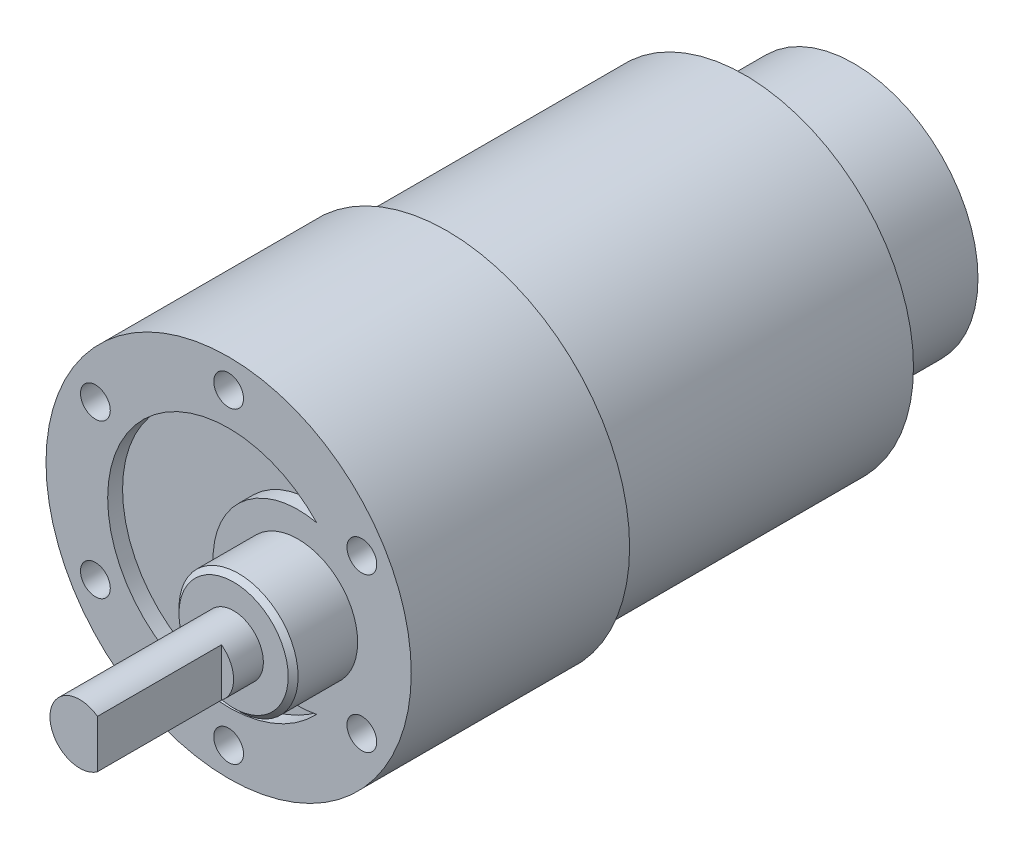
ISO-10303-21;
HEADER;
FILE_DESCRIPTION(('STEP AP214'),'2;1');
FILE_NAME('part.step','',(''),(''),'','','');
FILE_SCHEMA(('AUTOMOTIVE_DESIGN { 1 0 10303 214 1 1 1 1 }'));
ENDSEC;
DATA;
#1=APPLICATION_CONTEXT('core data for automotive mechanical design processes');
#2=APPLICATION_PROTOCOL_DEFINITION('international standard','automotive_design',2000,#1);
#3=PRODUCT_CONTEXT('',#1,'mechanical');
#4=PRODUCT('Part','Part','',(#3));
#5=PRODUCT_RELATED_PRODUCT_CATEGORY('part','',(#4));
#6=PRODUCT_DEFINITION_FORMATION('','',#4);
#7=PRODUCT_DEFINITION_CONTEXT('part definition',#1,'design');
#8=PRODUCT_DEFINITION('design','',#6,#7);
#9=PRODUCT_DEFINITION_SHAPE('','',#8);
#10=(LENGTH_UNIT() NAMED_UNIT(*) SI_UNIT(.MILLI.,.METRE.));
#11=(NAMED_UNIT(*) PLANE_ANGLE_UNIT() SI_UNIT($,.RADIAN.));
#12=(NAMED_UNIT(*) SI_UNIT($,.STERADIAN.) SOLID_ANGLE_UNIT());
#13=UNCERTAINTY_MEASURE_WITH_UNIT(LENGTH_MEASURE(1.E-05),#10,'distance_accuracy_value','');
#14=(GEOMETRIC_REPRESENTATION_CONTEXT(3) GLOBAL_UNCERTAINTY_ASSIGNED_CONTEXT((#13)) GLOBAL_UNIT_ASSIGNED_CONTEXT((#10,
#11,#12)) REPRESENTATION_CONTEXT('',''));
#15=CARTESIAN_POINT('',(0.,0.,0.));
#16=DIRECTION('',(0.,0.,1.));
#17=DIRECTION('',(1.,0.,0.));
#18=AXIS2_PLACEMENT_3D('',#15,#16,#17);
#19=CARTESIAN_POINT('',(0.,0.,0.));
#20=DIRECTION('',(0.,0.,1.));
#21=DIRECTION('',(1.,0.,0.));
#22=AXIS2_PLACEMENT_3D('',#19,#20,#21);
#23=PLANE('',#22);
#24=CARTESIAN_POINT('',(0.,0.,0.));
#25=DIRECTION('',(0.,0.,1.));
#26=DIRECTION('',(1.,0.,0.));
#27=AXIS2_PLACEMENT_3D('',#24,#25,#26);
#28=CIRCLE('',#27,17.);
#29=CARTESIAN_POINT('',(17.,0.,0.));
#30=VERTEX_POINT('',#29);
#31=EDGE_CURVE('E145',#30,#30,#28,.T.);
#32=ORIENTED_EDGE('',*,*,#31,.F.);
#33=EDGE_LOOP('',(#32));
#34=FACE_BOUND('',#33,.T.);
#35=CARTESIAN_POINT('',(0.,0.,0.));
#36=DIRECTION('',(0.,0.,1.));
#37=DIRECTION('',(1.,0.,0.));
#38=AXIS2_PLACEMENT_3D('',#35,#36,#37);
#39=CIRCLE('',#38,12.5);
#40=CARTESIAN_POINT('',(12.5,0.,0.));
#41=VERTEX_POINT('',#40);
#42=EDGE_CURVE('E13',#41,#41,#39,.F.);
#43=ORIENTED_EDGE('',*,*,#42,.F.);
#44=EDGE_LOOP('',(#43));
#45=FACE_BOUND('',#44,.T.);
#46=ADVANCED_FACE('F37',(#34,#45),#23,.F.);
#47=CARTESIAN_POINT('',(0.,0.,52.));
#48=DIRECTION('',(0.,0.,1.));
#49=DIRECTION('',(1.,0.,0.));
#50=AXIS2_PLACEMENT_3D('',#47,#48,#49);
#51=PLANE('',#50);
#52=CARTESIAN_POINT('',(7.,0.,52.));
#53=DIRECTION('',(0.,0.,1.));
#54=DIRECTION('',(1.,0.,0.));
#55=AXIS2_PLACEMENT_3D('',#52,#53,#54);
#56=CIRCLE('',#55,6.);
#57=CARTESIAN_POINT('',(13.,0.,52.));
#58=VERTEX_POINT('',#57);
#59=EDGE_CURVE('E93',#58,#58,#56,.T.);
#60=ORIENTED_EDGE('',*,*,#59,.F.);
#61=EDGE_LOOP('',(#60));
#62=FACE_BOUND('',#61,.T.);
#63=CARTESIAN_POINT('',(-13.4233937586587,7.75000000000016,52.));
#64=DIRECTION('',(0.,0.,1.));
#65=DIRECTION('',(1.,0.,0.));
#66=AXIS2_PLACEMENT_3D('',#63,#64,#65);
#67=CIRCLE('',#66,1.5);
#68=CARTESIAN_POINT('',(-11.9233937586587,7.75000000000016,52.));
#69=VERTEX_POINT('',#68);
#70=EDGE_CURVE('E97',#69,#69,#67,.T.);
#71=ORIENTED_EDGE('',*,*,#70,.F.);
#72=EDGE_LOOP('',(#71));
#73=FACE_BOUND('',#72,.T.);
#74=CARTESIAN_POINT('',(-13.4233937586589,-7.74999999999987,52.));
#75=DIRECTION('',(0.,0.,1.));
#76=DIRECTION('',(1.,0.,0.));
#77=AXIS2_PLACEMENT_3D('',#74,#75,#76);
#78=CIRCLE('',#77,1.5);
#79=CARTESIAN_POINT('',(-11.9233937586589,-7.74999999999987,52.));
#80=VERTEX_POINT('',#79);
#81=EDGE_CURVE('E109',#80,#80,#78,.T.);
#82=ORIENTED_EDGE('',*,*,#81,.F.);
#83=EDGE_LOOP('',(#82));
#84=FACE_BOUND('',#83,.T.);
#85=CARTESIAN_POINT('',(-1.08235921504137E-13,-15.5,52.));
#86=DIRECTION('',(0.,0.,1.));
#87=DIRECTION('',(1.,0.,0.));
#88=AXIS2_PLACEMENT_3D('',#85,#86,#87);
#89=CIRCLE('',#88,1.5);
#90=CARTESIAN_POINT('',(1.49999999999989,-15.5,52.));
#91=VERTEX_POINT('',#90);
#92=EDGE_CURVE('E115',#91,#91,#89,.T.);
#93=ORIENTED_EDGE('',*,*,#92,.F.);
#94=EDGE_LOOP('',(#93));
#95=FACE_BOUND('',#94,.T.);
#96=CARTESIAN_POINT('',(13.4233937586588,-7.75000000000006,52.));
#97=DIRECTION('',(0.,0.,1.));
#98=DIRECTION('',(1.,0.,0.));
#99=AXIS2_PLACEMENT_3D('',#96,#97,#98);
#100=CIRCLE('',#99,1.5);
#101=CARTESIAN_POINT('',(14.9233937586588,-7.75000000000006,52.));
#102=VERTEX_POINT('',#101);
#103=EDGE_CURVE('E121',#102,#102,#100,.T.);
#104=ORIENTED_EDGE('',*,*,#103,.F.);
#105=EDGE_LOOP('',(#104));
#106=FACE_BOUND('',#105,.T.);
#107=CARTESIAN_POINT('',(13.4233937586588,7.74999999999997,52.));
#108=DIRECTION('',(0.,0.,1.));
#109=DIRECTION('',(1.,0.,0.));
#110=AXIS2_PLACEMENT_3D('',#107,#108,#109);
#111=CIRCLE('',#110,1.5);
#112=CARTESIAN_POINT('',(14.9233937586588,7.74999999999997,52.));
#113=VERTEX_POINT('',#112);
#114=EDGE_CURVE('E127',#113,#113,#111,.T.);
#115=ORIENTED_EDGE('',*,*,#114,.F.);
#116=EDGE_LOOP('',(#115));
#117=FACE_BOUND('',#116,.T.);
#118=CARTESIAN_POINT('',(0.,15.5,52.));
#119=DIRECTION('',(0.,0.,1.));
#120=DIRECTION('',(1.,0.,0.));
#121=AXIS2_PLACEMENT_3D('',#118,#119,#120);
#122=CIRCLE('',#121,1.5);
#123=CARTESIAN_POINT('',(1.5,15.5,52.));
#124=VERTEX_POINT('',#123);
#125=EDGE_CURVE('E133',#124,#124,#122,.T.);
#126=ORIENTED_EDGE('',*,*,#125,.F.);
#127=EDGE_LOOP('',(#126));
#128=FACE_BOUND('',#127,.T.);
#129=CARTESIAN_POINT('',(0.,0.,52.));
#130=DIRECTION('',(0.,0.,1.));
#131=DIRECTION('',(1.,0.,0.));
#132=AXIS2_PLACEMENT_3D('',#129,#130,#131);
#133=CIRCLE('',#132,18.4);
#134=CARTESIAN_POINT('',(18.4,0.,52.));
#135=VERTEX_POINT('',#134);
#136=EDGE_CURVE('E142',#135,#135,#133,.T.);
#137=ORIENTED_EDGE('',*,*,#136,.T.);
#138=EDGE_LOOP('',(#137));
#139=FACE_BOUND('',#138,.T.);
#140=CARTESIAN_POINT('',(0.,0.,52.));
#141=DIRECTION('',(0.,0.,1.));
#142=DIRECTION('',(1.,0.,0.));
#143=AXIS2_PLACEMENT_3D('',#140,#141,#142);
#144=CIRCLE('',#143,12.1872331613627);
#145=CARTESIAN_POINT('',(8.86813473528428,8.35971521322723,52.));
#146=VERTEX_POINT('',#145);
#147=CARTESIAN_POINT('',(8.86813473528428,-8.35971521322723,52.));
#148=VERTEX_POINT('',#147);
#149=EDGE_CURVE('E381',#146,#148,#144,.T.);
#150=ORIENTED_EDGE('',*,*,#149,.F.);
#151=CARTESIAN_POINT('',(7.,0.,52.));
#152=DIRECTION('',(0.,0.,1.));
#153=DIRECTION('',(1.,0.,0.));
#154=AXIS2_PLACEMENT_3D('',#151,#152,#153);
#155=CIRCLE('',#154,8.56590718111272);
#156=EDGE_CURVE('E60',#146,#148,#155,.T.);
#157=ORIENTED_EDGE('',*,*,#156,.T.);
#158=EDGE_LOOP('',(#150,#157));
#159=FACE_BOUND('',#158,.T.);
#160=ADVANCED_FACE('F172',(#62,#73,#84,#95,#106,#117,#128,#139,#159),#51,.T.);
#161=CARTESIAN_POINT('',(7.,0.,58.5));
#162=DIRECTION('',(0.,0.,1.));
#163=DIRECTION('',(1.,0.,0.));
#164=AXIS2_PLACEMENT_3D('',#161,#162,#163);
#165=PLANE('',#164);
#166=CARTESIAN_POINT('',(7.,0.,58.5));
#167=DIRECTION('',(0.,0.,1.));
#168=DIRECTION('',(1.,0.,0.));
#169=AXIS2_PLACEMENT_3D('',#166,#167,#168);
#170=CIRCLE('',#169,5.50000000000002);
#171=CARTESIAN_POINT('',(12.5,0.,58.5));
#172=VERTEX_POINT('',#171);
#173=EDGE_CURVE('E156',#172,#172,#170,.T.);
#174=ORIENTED_EDGE('',*,*,#173,.T.);
#175=EDGE_LOOP('',(#174));
#176=FACE_BOUND('',#175,.T.);
#177=CARTESIAN_POINT('',(7.,0.,58.5));
#178=DIRECTION('',(0.,0.,1.));
#179=DIRECTION('',(1.,0.,0.));
#180=AXIS2_PLACEMENT_3D('',#177,#178,#179);
#181=CIRCLE('',#180,3.);
#182=CARTESIAN_POINT('',(10.,0.,58.5));
#183=VERTEX_POINT('',#182);
#184=EDGE_CURVE('E94',#183,#183,#181,.T.);
#185=ORIENTED_EDGE('',*,*,#184,.F.);
#186=EDGE_LOOP('',(#185));
#187=FACE_BOUND('',#186,.T.);
#188=ADVANCED_FACE('F168',(#176,#187),#165,.T.);
#189=CARTESIAN_POINT('',(0.,0.,30.));
#190=DIRECTION('',(0.,0.,-1.));
#191=DIRECTION('',(-1.,0.,0.));
#192=AXIS2_PLACEMENT_3D('',#189,#190,#191);
#193=CYLINDRICAL_SURFACE('',#192,17.);
#194=CARTESIAN_POINT('',(0.,0.,29.));
#195=DIRECTION('',(0.,0.,1.));
#196=DIRECTION('',(1.,0.,0.));
#197=AXIS2_PLACEMENT_3D('',#194,#195,#196);
#198=CIRCLE('',#197,17.);
#199=CARTESIAN_POINT('',(17.,0.,29.));
#200=VERTEX_POINT('',#199);
#201=EDGE_CURVE('E153',#200,#200,#198,.F.);
#202=ORIENTED_EDGE('',*,*,#201,.T.);
#203=EDGE_LOOP('',(#202));
#204=FACE_BOUND('',#203,.T.);
#205=ORIENTED_EDGE('',*,*,#31,.T.);
#206=EDGE_LOOP('',(#205));
#207=FACE_BOUND('',#206,.T.);
#208=ADVANCED_FACE('F171',(#204,#207),#193,.T.);
#209=CARTESIAN_POINT('',(0.,0.,29.));
#210=DIRECTION('',(0.,0.,1.));
#211=DIRECTION('',(1.,0.,0.));
#212=AXIS2_PLACEMENT_3D('',#209,#210,#211);
#213=TOROIDAL_SURFACE('',#212,16.,1.);
#214=ORIENTED_EDGE('',*,*,#201,.F.);
#215=EDGE_LOOP('',(#214));
#216=FACE_BOUND('',#215,.T.);
#217=CARTESIAN_POINT('',(0.,0.,30.));
#218=DIRECTION('',(0.,0.,1.));
#219=DIRECTION('',(1.,0.,0.));
#220=AXIS2_PLACEMENT_3D('',#217,#218,#219);
#221=CIRCLE('',#220,16.);
#222=CARTESIAN_POINT('',(16.,0.,30.));
#223=VERTEX_POINT('',#222);
#224=EDGE_CURVE('E150',#223,#223,#221,.T.);
#225=ORIENTED_EDGE('',*,*,#224,.F.);
#226=EDGE_LOOP('',(#225));
#227=FACE_BOUND('',#226,.T.);
#228=ADVANCED_FACE('F197',(#216,#227),#213,.T.);
#229=CARTESIAN_POINT('',(0.,0.,52.));
#230=DIRECTION('',(0.,0.,-1.));
#231=DIRECTION('',(-1.,0.,0.));
#232=AXIS2_PLACEMENT_3D('',#229,#230,#231);
#233=CYLINDRICAL_SURFACE('',#232,18.4);
#234=ORIENTED_EDGE('',*,*,#136,.F.);
#235=EDGE_LOOP('',(#234));
#236=FACE_BOUND('',#235,.T.);
#237=CARTESIAN_POINT('',(0.,0.,30.));
#238=DIRECTION('',(0.,0.,1.));
#239=DIRECTION('',(1.,0.,0.));
#240=AXIS2_PLACEMENT_3D('',#237,#238,#239);
#241=CIRCLE('',#240,18.4);
#242=CARTESIAN_POINT('',(18.4,0.,30.));
#243=VERTEX_POINT('',#242);
#244=EDGE_CURVE('E139',#243,#243,#241,.T.);
#245=ORIENTED_EDGE('',*,*,#244,.T.);
#246=EDGE_LOOP('',(#245));
#247=FACE_BOUND('',#246,.T.);
#248=ADVANCED_FACE('F194',(#236,#247),#233,.T.);
#249=CARTESIAN_POINT('',(0.,0.,30.));
#250=DIRECTION('',(0.,0.,1.));
#251=DIRECTION('',(1.,0.,0.));
#252=AXIS2_PLACEMENT_3D('',#249,#250,#251);
#253=PLANE('',#252);
#254=ORIENTED_EDGE('',*,*,#224,.T.);
#255=EDGE_LOOP('',(#254));
#256=FACE_BOUND('',#255,.T.);
#257=ORIENTED_EDGE('',*,*,#244,.F.);
#258=EDGE_LOOP('',(#257));
#259=FACE_BOUND('',#258,.T.);
#260=ADVANCED_FACE('F204',(#256,#259),#253,.F.);
#261=CARTESIAN_POINT('',(0.,15.5,49.));
#262=DIRECTION('',(0.,0.,1.));
#263=DIRECTION('',(1.,0.,0.));
#264=AXIS2_PLACEMENT_3D('',#261,#262,#263);
#265=CYLINDRICAL_SURFACE('',#264,1.5);
#266=CARTESIAN_POINT('',(0.,15.5,49.));
#267=DIRECTION('',(0.,0.,1.));
#268=DIRECTION('',(1.,0.,0.));
#269=AXIS2_PLACEMENT_3D('',#266,#267,#268);
#270=CIRCLE('',#269,1.5);
#271=CARTESIAN_POINT('',(1.5,15.5,49.));
#272=VERTEX_POINT('',#271);
#273=EDGE_CURVE('E136',#272,#272,#270,.T.);
#274=ORIENTED_EDGE('',*,*,#273,.F.);
#275=EDGE_LOOP('',(#274));
#276=FACE_BOUND('',#275,.T.);
#277=ORIENTED_EDGE('',*,*,#125,.T.);
#278=EDGE_LOOP('',(#277));
#279=FACE_BOUND('',#278,.T.);
#280=ADVANCED_FACE('F212',(#276,#279),#265,.F.);
#281=CARTESIAN_POINT('',(0.,15.5,49.));
#282=DIRECTION('',(0.,0.,1.));
#283=DIRECTION('',(1.,0.,0.));
#284=AXIS2_PLACEMENT_3D('',#281,#282,#283);
#285=PLANE('',#284);
#286=ORIENTED_EDGE('',*,*,#273,.T.);
#287=EDGE_LOOP('',(#286));
#288=FACE_BOUND('',#287,.T.);
#289=ADVANCED_FACE('F218',(#288),#285,.T.);
#290=CARTESIAN_POINT('',(13.4233937586588,7.74999999999997,49.));
#291=DIRECTION('',(0.,0.,1.));
#292=DIRECTION('',(1.,0.,0.));
#293=AXIS2_PLACEMENT_3D('',#290,#291,#292);
#294=CYLINDRICAL_SURFACE('',#293,1.5);
#295=CARTESIAN_POINT('',(13.4233937586588,7.74999999999997,49.));
#296=DIRECTION('',(0.,0.,1.));
#297=DIRECTION('',(1.,0.,0.));
#298=AXIS2_PLACEMENT_3D('',#295,#296,#297);
#299=CIRCLE('',#298,1.5);
#300=CARTESIAN_POINT('',(14.9233937586588,7.74999999999997,49.));
#301=VERTEX_POINT('',#300);
#302=EDGE_CURVE('E130',#301,#301,#299,.T.);
#303=ORIENTED_EDGE('',*,*,#302,.F.);
#304=EDGE_LOOP('',(#303));
#305=FACE_BOUND('',#304,.T.);
#306=ORIENTED_EDGE('',*,*,#114,.T.);
#307=EDGE_LOOP('',(#306));
#308=FACE_BOUND('',#307,.T.);
#309=ADVANCED_FACE('F224',(#305,#308),#294,.F.);
#310=CARTESIAN_POINT('',(13.4233937586588,7.74999999999997,49.));
#311=DIRECTION('',(0.,0.,1.));
#312=DIRECTION('',(1.,0.,0.));
#313=AXIS2_PLACEMENT_3D('',#310,#311,#312);
#314=PLANE('',#313);
#315=ORIENTED_EDGE('',*,*,#302,.T.);
#316=EDGE_LOOP('',(#315));
#317=FACE_BOUND('',#316,.T.);
#318=ADVANCED_FACE('F228',(#317),#314,.T.);
#319=CARTESIAN_POINT('',(13.4233937586588,-7.75000000000006,49.));
#320=DIRECTION('',(0.,0.,1.));
#321=DIRECTION('',(1.,0.,0.));
#322=AXIS2_PLACEMENT_3D('',#319,#320,#321);
#323=CYLINDRICAL_SURFACE('',#322,1.5);
#324=CARTESIAN_POINT('',(13.4233937586588,-7.75000000000006,49.));
#325=DIRECTION('',(0.,0.,1.));
#326=DIRECTION('',(1.,0.,0.));
#327=AXIS2_PLACEMENT_3D('',#324,#325,#326);
#328=CIRCLE('',#327,1.5);
#329=CARTESIAN_POINT('',(14.9233937586588,-7.75000000000006,49.));
#330=VERTEX_POINT('',#329);
#331=EDGE_CURVE('E124',#330,#330,#328,.T.);
#332=ORIENTED_EDGE('',*,*,#331,.F.);
#333=EDGE_LOOP('',(#332));
#334=FACE_BOUND('',#333,.T.);
#335=ORIENTED_EDGE('',*,*,#103,.T.);
#336=EDGE_LOOP('',(#335));
#337=FACE_BOUND('',#336,.T.);
#338=ADVANCED_FACE('F232',(#334,#337),#323,.F.);
#339=CARTESIAN_POINT('',(13.4233937586588,-7.75000000000006,49.));
#340=DIRECTION('',(0.,0.,1.));
#341=DIRECTION('',(1.,0.,0.));
#342=AXIS2_PLACEMENT_3D('',#339,#340,#341);
#343=PLANE('',#342);
#344=ORIENTED_EDGE('',*,*,#331,.T.);
#345=EDGE_LOOP('',(#344));
#346=FACE_BOUND('',#345,.T.);
#347=ADVANCED_FACE('F236',(#346),#343,.T.);
#348=CARTESIAN_POINT('',(-1.08235921504137E-13,-15.5,49.));
#349=DIRECTION('',(0.,0.,1.));
#350=DIRECTION('',(1.,0.,0.));
#351=AXIS2_PLACEMENT_3D('',#348,#349,#350);
#352=CYLINDRICAL_SURFACE('',#351,1.5);
#353=CARTESIAN_POINT('',(-1.08235921504137E-13,-15.5,49.));
#354=DIRECTION('',(0.,0.,1.));
#355=DIRECTION('',(1.,0.,0.));
#356=AXIS2_PLACEMENT_3D('',#353,#354,#355);
#357=CIRCLE('',#356,1.5);
#358=CARTESIAN_POINT('',(1.49999999999989,-15.5,49.));
#359=VERTEX_POINT('',#358);
#360=EDGE_CURVE('E118',#359,#359,#357,.T.);
#361=ORIENTED_EDGE('',*,*,#360,.F.);
#362=EDGE_LOOP('',(#361));
#363=FACE_BOUND('',#362,.T.);
#364=ORIENTED_EDGE('',*,*,#92,.T.);
#365=EDGE_LOOP('',(#364));
#366=FACE_BOUND('',#365,.T.);
#367=ADVANCED_FACE('F240',(#363,#366),#352,.F.);
#368=CARTESIAN_POINT('',(-1.08235921504137E-13,-15.5,49.));
#369=DIRECTION('',(0.,0.,1.));
#370=DIRECTION('',(1.,0.,0.));
#371=AXIS2_PLACEMENT_3D('',#368,#369,#370);
#372=PLANE('',#371);
#373=ORIENTED_EDGE('',*,*,#360,.T.);
#374=EDGE_LOOP('',(#373));
#375=FACE_BOUND('',#374,.T.);
#376=ADVANCED_FACE('F244',(#375),#372,.T.);
#377=CARTESIAN_POINT('',(-13.4233937586589,-7.74999999999987,49.));
#378=DIRECTION('',(0.,0.,1.));
#379=DIRECTION('',(1.,0.,0.));
#380=AXIS2_PLACEMENT_3D('',#377,#378,#379);
#381=CYLINDRICAL_SURFACE('',#380,1.5);
#382=CARTESIAN_POINT('',(-13.4233937586589,-7.74999999999987,49.));
#383=DIRECTION('',(0.,0.,1.));
#384=DIRECTION('',(1.,0.,0.));
#385=AXIS2_PLACEMENT_3D('',#382,#383,#384);
#386=CIRCLE('',#385,1.5);
#387=CARTESIAN_POINT('',(-11.9233937586589,-7.74999999999987,49.));
#388=VERTEX_POINT('',#387);
#389=EDGE_CURVE('E112',#388,#388,#386,.T.);
#390=ORIENTED_EDGE('',*,*,#389,.F.);
#391=EDGE_LOOP('',(#390));
#392=FACE_BOUND('',#391,.T.);
#393=ORIENTED_EDGE('',*,*,#81,.T.);
#394=EDGE_LOOP('',(#393));
#395=FACE_BOUND('',#394,.T.);
#396=ADVANCED_FACE('F248',(#392,#395),#381,.F.);
#397=CARTESIAN_POINT('',(-13.4233937586589,-7.74999999999987,49.));
#398=DIRECTION('',(0.,0.,1.));
#399=DIRECTION('',(1.,0.,0.));
#400=AXIS2_PLACEMENT_3D('',#397,#398,#399);
#401=PLANE('',#400);
#402=ORIENTED_EDGE('',*,*,#389,.T.);
#403=EDGE_LOOP('',(#402));
#404=FACE_BOUND('',#403,.T.);
#405=ADVANCED_FACE('F252',(#404),#401,.T.);
#406=CARTESIAN_POINT('',(-13.4233937586587,7.75000000000016,49.));
#407=DIRECTION('',(0.,0.,1.));
#408=DIRECTION('',(1.,0.,0.));
#409=AXIS2_PLACEMENT_3D('',#406,#407,#408);
#410=CYLINDRICAL_SURFACE('',#409,1.5);
#411=CARTESIAN_POINT('',(-13.4233937586587,7.75000000000016,49.));
#412=DIRECTION('',(0.,0.,1.));
#413=DIRECTION('',(1.,0.,0.));
#414=AXIS2_PLACEMENT_3D('',#411,#412,#413);
#415=CIRCLE('',#414,1.5);
#416=CARTESIAN_POINT('',(-11.9233937586587,7.75000000000016,49.));
#417=VERTEX_POINT('',#416);
#418=EDGE_CURVE('E106',#417,#417,#415,.T.);
#419=ORIENTED_EDGE('',*,*,#418,.F.);
#420=EDGE_LOOP('',(#419));
#421=FACE_BOUND('',#420,.T.);
#422=ORIENTED_EDGE('',*,*,#70,.T.);
#423=EDGE_LOOP('',(#422));
#424=FACE_BOUND('',#423,.T.);
#425=ADVANCED_FACE('F256',(#421,#424),#410,.F.);
#426=CARTESIAN_POINT('',(-13.4233937586587,7.75000000000016,49.));
#427=DIRECTION('',(0.,0.,1.));
#428=DIRECTION('',(1.,0.,0.));
#429=AXIS2_PLACEMENT_3D('',#426,#427,#428);
#430=PLANE('',#429);
#431=ORIENTED_EDGE('',*,*,#418,.T.);
#432=EDGE_LOOP('',(#431));
#433=FACE_BOUND('',#432,.T.);
#434=ADVANCED_FACE('F260',(#433),#430,.T.);
#435=CARTESIAN_POINT('',(7.,0.,58.5));
#436=DIRECTION('',(0.,0.,-1.));
#437=DIRECTION('',(-1.,0.,0.));
#438=AXIS2_PLACEMENT_3D('',#435,#436,#437);
#439=CYLINDRICAL_SURFACE('',#438,6.);
#440=CARTESIAN_POINT('',(7.,0.,58.));
#441=DIRECTION('',(0.,0.,1.));
#442=DIRECTION('',(1.,0.,0.));
#443=AXIS2_PLACEMENT_3D('',#440,#441,#442);
#444=CIRCLE('',#443,6.);
#445=CARTESIAN_POINT('',(13.,0.,58.));
#446=VERTEX_POINT('',#445);
#447=EDGE_CURVE('E45',#446,#446,#444,.F.);
#448=ORIENTED_EDGE('',*,*,#447,.T.);
#449=EDGE_LOOP('',(#448));
#450=FACE_BOUND('',#449,.T.);
#451=ORIENTED_EDGE('',*,*,#59,.T.);
#452=EDGE_LOOP('',(#451));
#453=FACE_BOUND('',#452,.T.);
#454=ADVANCED_FACE('F161',(#450,#453),#439,.T.);
#455=CARTESIAN_POINT('',(7.,0.,58.5));
#456=DIRECTION('',(0.,0.,-1.));
#457=DIRECTION('',(-1.,0.,0.));
#458=AXIS2_PLACEMENT_3D('',#455,#456,#457);
#459=CONICAL_SURFACE('',#458,5.50000000000002,0.785398163397445);
#460=ORIENTED_EDGE('',*,*,#447,.F.);
#461=EDGE_LOOP('',(#460));
#462=FACE_BOUND('',#461,.T.);
#463=ORIENTED_EDGE('',*,*,#173,.F.);
#464=EDGE_LOOP('',(#463));
#465=FACE_BOUND('',#464,.T.);
#466=ADVANCED_FACE('F39',(#462,#465),#459,.T.);
#467=CARTESIAN_POINT('',(7.,0.,74.));
#468=DIRECTION('',(0.,0.,-1.));
#469=DIRECTION('',(-1.,0.,0.));
#470=AXIS2_PLACEMENT_3D('',#467,#468,#469);
#471=CYLINDRICAL_SURFACE('',#470,3.);
#472=CARTESIAN_POINT('',(7.,0.,74.));
#473=DIRECTION('',(0.,0.,1.));
#474=DIRECTION('',(1.,0.,0.));
#475=AXIS2_PLACEMENT_3D('',#472,#473,#474);
#476=CIRCLE('',#475,3.);
#477=CARTESIAN_POINT('',(8.77935190468652,2.41534817351214,74.));
#478=VERTEX_POINT('',#477);
#479=CARTESIAN_POINT('',(8.77935190468652,-2.41534817351214,74.));
#480=VERTEX_POINT('',#479);
#481=EDGE_CURVE('E88',#478,#480,#476,.T.);
#482=ORIENTED_EDGE('',*,*,#481,.F.);
#483=DIRECTION('',(0.,0.,1.));
#484=VECTOR('',#483,1.);
#485=CARTESIAN_POINT('',(8.77935190468652,2.41534817351214,53.5174696217939));
#486=LINE('',#485,#484);
#487=CARTESIAN_POINT('',(8.77935190468652,2.41534817351214,61.5));
#488=VERTEX_POINT('',#487);
#489=EDGE_CURVE('E52',#488,#478,#486,.T.);
#490=ORIENTED_EDGE('',*,*,#489,.F.);
#491=CARTESIAN_POINT('',(7.,0.,61.5));
#492=DIRECTION('',(0.,0.,1.));
#493=DIRECTION('',(1.,0.,0.));
#494=AXIS2_PLACEMENT_3D('',#491,#492,#493);
#495=CIRCLE('',#494,3.);
#496=CARTESIAN_POINT('',(8.77935190468652,-2.41534817351214,61.5));
#497=VERTEX_POINT('',#496);
#498=EDGE_CURVE('E90',#488,#497,#495,.F.);
#499=ORIENTED_EDGE('',*,*,#498,.T.);
#500=DIRECTION('',(0.,0.,1.));
#501=VECTOR('',#500,1.);
#502=CARTESIAN_POINT('',(8.77935190468652,-2.41534817351214,53.5174696217939));
#503=LINE('',#502,#501);
#504=EDGE_CURVE('E78',#497,#480,#503,.T.);
#505=ORIENTED_EDGE('',*,*,#504,.T.);
#506=EDGE_LOOP('',(#482,#490,#499,#505));
#507=FACE_BOUND('',#506,.T.);
#508=ORIENTED_EDGE('',*,*,#184,.T.);
#509=EDGE_LOOP('',(#508));
#510=FACE_BOUND('',#509,.T.);
#511=ADVANCED_FACE('F86',(#507,#510),#471,.T.);
#512=CARTESIAN_POINT('',(7.,0.,74.));
#513=DIRECTION('',(0.,0.,1.));
#514=DIRECTION('',(1.,0.,0.));
#515=AXIS2_PLACEMENT_3D('',#512,#513,#514);
#516=PLANE('',#515);
#517=DIRECTION('',(0.,-1.,0.));
#518=VECTOR('',#517,1.);
#519=CARTESIAN_POINT('',(8.77935190468652,2.41534817351214,74.));
#520=LINE('',#519,#518);
#521=EDGE_CURVE('E75',#478,#480,#520,.T.);
#522=ORIENTED_EDGE('',*,*,#521,.F.);
#523=ORIENTED_EDGE('',*,*,#481,.T.);
#524=EDGE_LOOP('',(#522,#523));
#525=FACE_BOUND('',#524,.T.);
#526=ADVANCED_FACE('F92',(#525),#516,.T.);
#527=CARTESIAN_POINT('',(7.,0.,50.5));
#528=DIRECTION('',(0.,0.,1.));
#529=DIRECTION('',(1.,0.,0.));
#530=AXIS2_PLACEMENT_3D('',#527,#528,#529);
#531=CYLINDRICAL_SURFACE('',#530,8.56590718111272);
#532=ORIENTED_EDGE('',*,*,#156,.F.);
#533=DIRECTION('',(0.,0.,1.));
#534=VECTOR('',#533,1.);
#535=CARTESIAN_POINT('',(8.86813473528428,8.35971521322723,50.5));
#536=LINE('',#535,#534);
#537=CARTESIAN_POINT('',(8.86813473528428,8.35971521322723,50.5));
#538=VERTEX_POINT('',#537);
#539=EDGE_CURVE('E103',#538,#146,#536,.T.);
#540=ORIENTED_EDGE('',*,*,#539,.F.);
#541=CARTESIAN_POINT('',(7.,0.,50.5));
#542=DIRECTION('',(0.,0.,1.));
#543=DIRECTION('',(1.,0.,0.));
#544=AXIS2_PLACEMENT_3D('',#541,#542,#543);
#545=CIRCLE('',#544,8.56590718111272);
#546=CARTESIAN_POINT('',(8.86813473528428,-8.35971521322723,50.5));
#547=VERTEX_POINT('',#546);
#548=EDGE_CURVE('E378',#538,#547,#545,.T.);
#549=ORIENTED_EDGE('',*,*,#548,.T.);
#550=DIRECTION('',(0.,0.,1.));
#551=VECTOR('',#550,1.);
#552=CARTESIAN_POINT('',(8.86813473528428,-8.35971521322723,50.5));
#553=LINE('',#552,#551);
#554=EDGE_CURVE('E100',#547,#148,#553,.T.);
#555=ORIENTED_EDGE('',*,*,#554,.T.);
#556=EDGE_LOOP('',(#532,#540,#549,#555));
#557=FACE_BOUND('',#556,.T.);
#558=ADVANCED_FACE('F180',(#557),#531,.T.);
#559=CARTESIAN_POINT('',(0.,0.,50.5));
#560=DIRECTION('',(0.,0.,1.));
#561=DIRECTION('',(1.,0.,0.));
#562=AXIS2_PLACEMENT_3D('',#559,#560,#561);
#563=CYLINDRICAL_SURFACE('',#562,12.1872331613627);
#564=ORIENTED_EDGE('',*,*,#149,.T.);
#565=ORIENTED_EDGE('',*,*,#554,.F.);
#566=CARTESIAN_POINT('',(0.,0.,50.5));
#567=DIRECTION('',(0.,0.,1.));
#568=DIRECTION('',(1.,0.,0.));
#569=AXIS2_PLACEMENT_3D('',#566,#567,#568);
#570=CIRCLE('',#569,12.1872331613627);
#571=EDGE_CURVE('E380',#538,#547,#570,.T.);
#572=ORIENTED_EDGE('',*,*,#571,.F.);
#573=ORIENTED_EDGE('',*,*,#539,.T.);
#574=EDGE_LOOP('',(#564,#565,#572,#573));
#575=FACE_BOUND('',#574,.T.);
#576=ADVANCED_FACE('F297',(#575),#563,.F.);
#577=CARTESIAN_POINT('',(0.,-40.6214213562373,50.5));
#578=DIRECTION('',(0.,0.,1.));
#579=DIRECTION('',(1.,0.,0.));
#580=AXIS2_PLACEMENT_3D('',#577,#578,#579);
#581=PLANE('',#580);
#582=ORIENTED_EDGE('',*,*,#548,.F.);
#583=ORIENTED_EDGE('',*,*,#571,.T.);
#584=EDGE_LOOP('',(#582,#583));
#585=FACE_BOUND('',#584,.T.);
#586=ADVANCED_FACE('F306',(#585),#581,.T.);
#587=CARTESIAN_POINT('',(0.,0.,-11.));
#588=DIRECTION('',(0.,0.,1.));
#589=DIRECTION('',(1.,0.,0.));
#590=AXIS2_PLACEMENT_3D('',#587,#588,#589);
#591=CYLINDRICAL_SURFACE('',#590,12.5);
#592=CARTESIAN_POINT('',(0.,0.,-11.));
#593=DIRECTION('',(0.,0.,-1.));
#594=DIRECTION('',(-1.,0.,0.));
#595=AXIS2_PLACEMENT_3D('',#592,#593,#594);
#596=CIRCLE('',#595,12.5);
#597=CARTESIAN_POINT('',(-12.5,0.,-11.));
#598=VERTEX_POINT('',#597);
#599=EDGE_CURVE('E375',#598,#598,#596,.T.);
#600=ORIENTED_EDGE('',*,*,#599,.F.);
#601=EDGE_LOOP('',(#600));
#602=FACE_BOUND('',#601,.T.);
#603=ORIENTED_EDGE('',*,*,#42,.T.);
#604=EDGE_LOOP('',(#603));
#605=FACE_BOUND('',#604,.T.);
#606=ADVANCED_FACE('F315',(#602,#605),#591,.T.);
#607=CARTESIAN_POINT('',(0.,0.,-11.));
#608=DIRECTION('',(0.,0.,-1.));
#609=DIRECTION('',(-1.,0.,0.));
#610=AXIS2_PLACEMENT_3D('',#607,#608,#609);
#611=PLANE('',#610);
#612=ORIENTED_EDGE('',*,*,#599,.T.);
#613=EDGE_LOOP('',(#612));
#614=FACE_BOUND('',#613,.T.);
#615=ADVANCED_FACE('F330',(#614),#611,.T.);
#616=CARTESIAN_POINT('',(8.77935190468652,2.41534817351214,53.5174696217939));
#617=DIRECTION('',(-1.,0.,0.));
#618=DIRECTION('',(0.,0.,1.));
#619=AXIS2_PLACEMENT_3D('',#616,#617,#618);
#620=PLANE('',#619);
#621=DIRECTION('',(0.,1.,0.));
#622=VECTOR('',#621,1.);
#623=CARTESIAN_POINT('',(8.77935190468652,2.41534817351214,61.5));
#624=LINE('',#623,#622);
#625=EDGE_CURVE('E370',#497,#488,#624,.T.);
#626=ORIENTED_EDGE('',*,*,#625,.T.);
#627=ORIENTED_EDGE('',*,*,#489,.T.);
#628=ORIENTED_EDGE('',*,*,#521,.T.);
#629=ORIENTED_EDGE('',*,*,#504,.F.);
#630=EDGE_LOOP('',(#626,#627,#628,#629));
#631=FACE_BOUND('',#630,.T.);
#632=ADVANCED_FACE('F77',(#631),#620,.F.);
#633=CARTESIAN_POINT('',(7.,0.,61.5));
#634=DIRECTION('',(0.,0.,1.));
#635=DIRECTION('',(1.,0.,0.));
#636=AXIS2_PLACEMENT_3D('',#633,#634,#635);
#637=PLANE('',#636);
#638=ORIENTED_EDGE('',*,*,#498,.F.);
#639=ORIENTED_EDGE('',*,*,#625,.F.);
#640=EDGE_LOOP('',(#638,#639));
#641=FACE_BOUND('',#640,.T.);
#642=ADVANCED_FACE('F357',(#641),#637,.T.);
#643=CLOSED_SHELL('',(#46,#160,#188,#208,#228,#248,#260,#280,#289,#309,#318,#338,#347,#367,#376,
#396,#405,#425,#434,#454,#466,#511,#526,#558,#576,#586,#606,#615,#632,#642));
#644=MANIFOLD_SOLID_BREP('B2',#643);
#645=ADVANCED_BREP_SHAPE_REPRESENTATION('',(#18,#644),#14);
#646=SHAPE_DEFINITION_REPRESENTATION(#9,#645);
ENDSEC;
END-ISO-10303-21;
